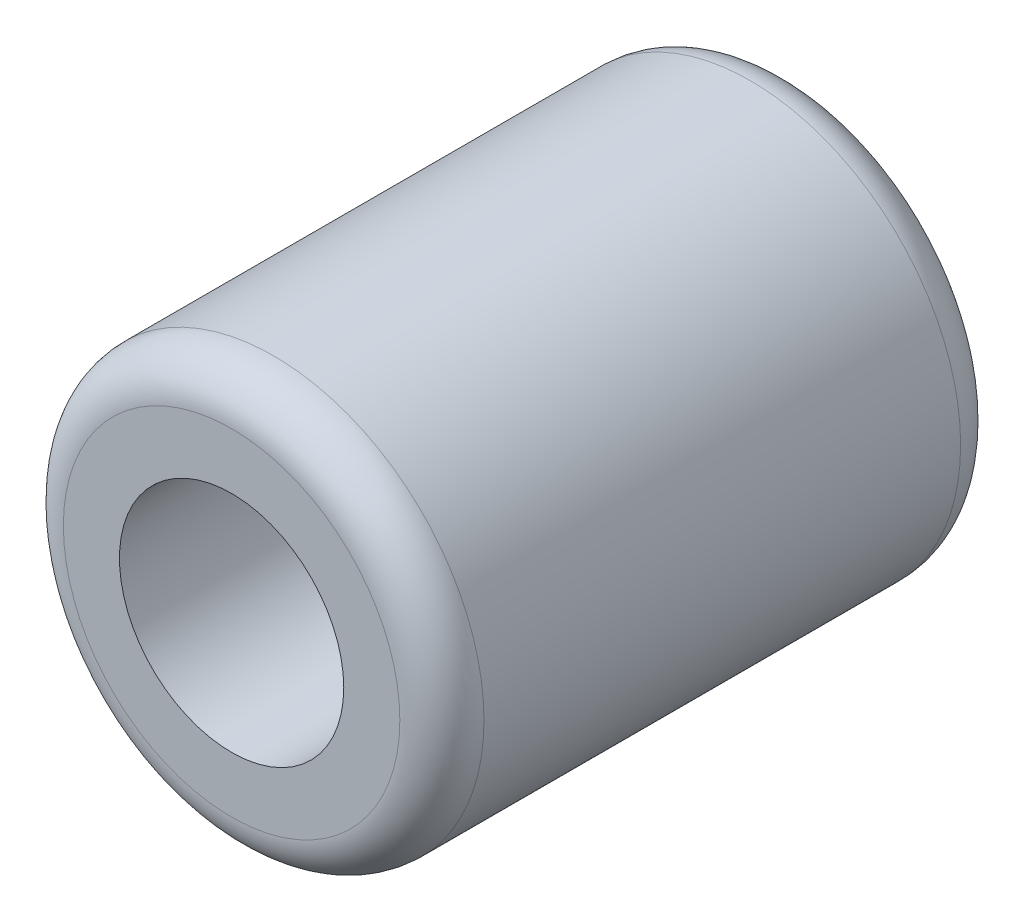
ISO-10303-21;
HEADER;
FILE_DESCRIPTION(('STEP AP214'),'2;1');
FILE_NAME('part.step','',(''),(''),'','','');
FILE_SCHEMA(('AUTOMOTIVE_DESIGN { 1 0 10303 214 1 1 1 1 }'));
ENDSEC;
DATA;
#1=APPLICATION_CONTEXT('core data for automotive mechanical design processes');
#2=APPLICATION_PROTOCOL_DEFINITION('international standard','automotive_design',2000,#1);
#3=PRODUCT_CONTEXT('',#1,'mechanical');
#4=PRODUCT('Part','Part','',(#3));
#5=PRODUCT_RELATED_PRODUCT_CATEGORY('part','',(#4));
#6=PRODUCT_DEFINITION_FORMATION('','',#4);
#7=PRODUCT_DEFINITION_CONTEXT('part definition',#1,'design');
#8=PRODUCT_DEFINITION('design','',#6,#7);
#9=PRODUCT_DEFINITION_SHAPE('','',#8);
#10=(LENGTH_UNIT() NAMED_UNIT(*) SI_UNIT(.MILLI.,.METRE.));
#11=(NAMED_UNIT(*) PLANE_ANGLE_UNIT() SI_UNIT($,.RADIAN.));
#12=(NAMED_UNIT(*) SI_UNIT($,.STERADIAN.) SOLID_ANGLE_UNIT());
#13=UNCERTAINTY_MEASURE_WITH_UNIT(LENGTH_MEASURE(1.E-05),#10,'distance_accuracy_value','');
#14=(GEOMETRIC_REPRESENTATION_CONTEXT(3) GLOBAL_UNCERTAINTY_ASSIGNED_CONTEXT((#13)) GLOBAL_UNIT_ASSIGNED_CONTEXT((#10,
#11,#12)) REPRESENTATION_CONTEXT('',''));
#15=CARTESIAN_POINT('',(0.,0.,0.));
#16=DIRECTION('',(0.,0.,1.));
#17=DIRECTION('',(1.,0.,0.));
#18=AXIS2_PLACEMENT_3D('',#15,#16,#17);
#19=CARTESIAN_POINT('',(0.,0.,20.));
#20=DIRECTION('',(0.,0.,1.));
#21=DIRECTION('',(1.,0.,0.));
#22=AXIS2_PLACEMENT_3D('',#19,#20,#21);
#23=PLANE('',#22);
#24=CARTESIAN_POINT('',(0.,0.,20.));
#25=DIRECTION('',(0.,0.,1.));
#26=DIRECTION('',(1.,0.,0.));
#27=AXIS2_PLACEMENT_3D('',#24,#25,#26);
#28=CIRCLE('',#27,12.);
#29=CARTESIAN_POINT('',(12.,0.,20.));
#30=VERTEX_POINT('',#29);
#31=EDGE_CURVE('E12',#30,#30,#28,.T.);
#32=ORIENTED_EDGE('',*,*,#31,.T.);
#33=EDGE_LOOP('',(#32));
#34=FACE_BOUND('',#33,.T.);
#35=CARTESIAN_POINT('',(0.,0.,20.));
#36=DIRECTION('',(0.,0.,1.));
#37=DIRECTION('',(1.,0.,0.));
#38=AXIS2_PLACEMENT_3D('',#35,#36,#37);
#39=CIRCLE('',#38,8.);
#40=CARTESIAN_POINT('',(8.,0.,20.));
#41=VERTEX_POINT('',#40);
#42=EDGE_CURVE('E66',#41,#41,#39,.T.);
#43=ORIENTED_EDGE('',*,*,#42,.F.);
#44=EDGE_LOOP('',(#43));
#45=FACE_BOUND('',#44,.T.);
#46=ADVANCED_FACE('F46',(#34,#45),#23,.T.);
#47=CARTESIAN_POINT('',(0.,0.,-20.));
#48=DIRECTION('',(0.,0.,1.));
#49=DIRECTION('',(1.,0.,0.));
#50=AXIS2_PLACEMENT_3D('',#47,#48,#49);
#51=PLANE('',#50);
#52=CARTESIAN_POINT('',(0.,0.,-20.));
#53=DIRECTION('',(0.,0.,1.));
#54=DIRECTION('',(1.,0.,0.));
#55=AXIS2_PLACEMENT_3D('',#52,#53,#54);
#56=CIRCLE('',#55,12.);
#57=CARTESIAN_POINT('',(12.,0.,-20.));
#58=VERTEX_POINT('',#57);
#59=EDGE_CURVE('E53',#58,#58,#56,.F.);
#60=ORIENTED_EDGE('',*,*,#59,.T.);
#61=EDGE_LOOP('',(#60));
#62=FACE_BOUND('',#61,.T.);
#63=CARTESIAN_POINT('',(0.,0.,-20.));
#64=DIRECTION('',(0.,0.,1.));
#65=DIRECTION('',(1.,0.,0.));
#66=AXIS2_PLACEMENT_3D('',#63,#64,#65);
#67=CIRCLE('',#66,8.);
#68=CARTESIAN_POINT('',(8.,0.,-20.));
#69=VERTEX_POINT('',#68);
#70=EDGE_CURVE('E67',#69,#69,#67,.T.);
#71=ORIENTED_EDGE('',*,*,#70,.T.);
#72=EDGE_LOOP('',(#71));
#73=FACE_BOUND('',#72,.T.);
#74=ADVANCED_FACE('F77',(#62,#73),#51,.F.);
#75=CARTESIAN_POINT('',(0.,0.,20.));
#76=DIRECTION('',(0.,0.,-1.));
#77=DIRECTION('',(-1.,0.,0.));
#78=AXIS2_PLACEMENT_3D('',#75,#76,#77);
#79=CYLINDRICAL_SURFACE('',#78,15.);
#80=CARTESIAN_POINT('',(0.,0.,-17.));
#81=DIRECTION('',(0.,0.,1.));
#82=DIRECTION('',(1.,0.,0.));
#83=AXIS2_PLACEMENT_3D('',#80,#81,#82);
#84=CIRCLE('',#83,15.);
#85=CARTESIAN_POINT('',(15.,0.,-17.));
#86=VERTEX_POINT('',#85);
#87=EDGE_CURVE('E57',#86,#86,#84,.T.);
#88=ORIENTED_EDGE('',*,*,#87,.T.);
#89=EDGE_LOOP('',(#88));
#90=FACE_BOUND('',#89,.T.);
#91=CARTESIAN_POINT('',(0.,0.,17.));
#92=DIRECTION('',(0.,0.,1.));
#93=DIRECTION('',(1.,0.,0.));
#94=AXIS2_PLACEMENT_3D('',#91,#92,#93);
#95=CIRCLE('',#94,15.);
#96=CARTESIAN_POINT('',(15.,0.,17.));
#97=VERTEX_POINT('',#96);
#98=EDGE_CURVE('E61',#97,#97,#95,.F.);
#99=ORIENTED_EDGE('',*,*,#98,.T.);
#100=EDGE_LOOP('',(#99));
#101=FACE_BOUND('',#100,.T.);
#102=ADVANCED_FACE('F82',(#90,#101),#79,.T.);
#103=CARTESIAN_POINT('',(0.,0.,20.));
#104=DIRECTION('',(0.,0.,-1.));
#105=DIRECTION('',(-1.,0.,0.));
#106=AXIS2_PLACEMENT_3D('',#103,#104,#105);
#107=CYLINDRICAL_SURFACE('',#106,8.);
#108=ORIENTED_EDGE('',*,*,#42,.T.);
#109=EDGE_LOOP('',(#108));
#110=FACE_BOUND('',#109,.T.);
#111=ORIENTED_EDGE('',*,*,#70,.F.);
#112=EDGE_LOOP('',(#111));
#113=FACE_BOUND('',#112,.T.);
#114=ADVANCED_FACE('F73',(#110,#113),#107,.F.);
#115=CARTESIAN_POINT('',(0.,0.,-17.));
#116=DIRECTION('',(0.,0.,1.));
#117=DIRECTION('',(1.,0.,0.));
#118=AXIS2_PLACEMENT_3D('',#115,#116,#117);
#119=TOROIDAL_SURFACE('',#118,12.,3.);
#120=ORIENTED_EDGE('',*,*,#59,.F.);
#121=EDGE_LOOP('',(#120));
#122=FACE_BOUND('',#121,.T.);
#123=ORIENTED_EDGE('',*,*,#87,.F.);
#124=EDGE_LOOP('',(#123));
#125=FACE_BOUND('',#124,.T.);
#126=ADVANCED_FACE('F88',(#122,#125),#119,.T.);
#127=CARTESIAN_POINT('',(0.,0.,17.));
#128=DIRECTION('',(0.,0.,1.));
#129=DIRECTION('',(1.,0.,0.));
#130=AXIS2_PLACEMENT_3D('',#127,#128,#129);
#131=TOROIDAL_SURFACE('',#130,12.,3.);
#132=ORIENTED_EDGE('',*,*,#98,.F.);
#133=EDGE_LOOP('',(#132));
#134=FACE_BOUND('',#133,.T.);
#135=ORIENTED_EDGE('',*,*,#31,.F.);
#136=EDGE_LOOP('',(#135));
#137=FACE_BOUND('',#136,.T.);
#138=ADVANCED_FACE('F48',(#134,#137),#131,.T.);
#139=CLOSED_SHELL('',(#46,#74,#102,#114,#126,#138));
#140=MANIFOLD_SOLID_BREP('B2',#139);
#141=ADVANCED_BREP_SHAPE_REPRESENTATION('',(#18,#140),#14);
#142=SHAPE_DEFINITION_REPRESENTATION(#9,#141);
ENDSEC;
END-ISO-10303-21;
